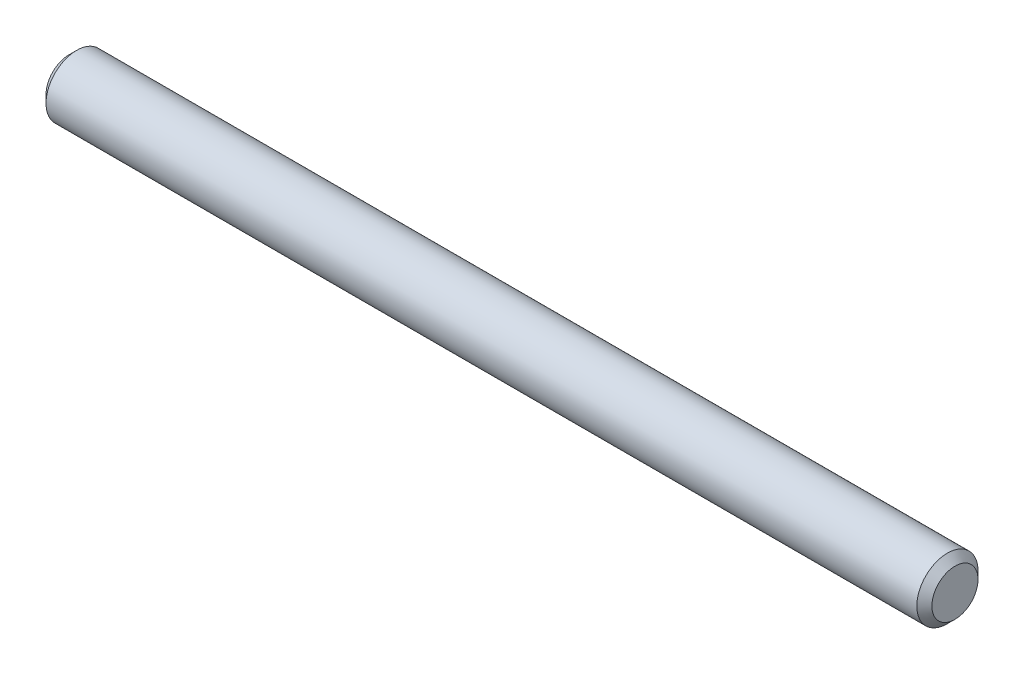
ISO-10303-21;
HEADER;
FILE_DESCRIPTION(('STEP AP214'),'2;1');
FILE_NAME('part.step','',(''),(''),'','','');
FILE_SCHEMA(('AUTOMOTIVE_DESIGN { 1 0 10303 214 1 1 1 1 }'));
ENDSEC;
DATA;
#1=APPLICATION_CONTEXT('core data for automotive mechanical design processes');
#2=APPLICATION_PROTOCOL_DEFINITION('international standard','automotive_design',2000,#1);
#3=PRODUCT_CONTEXT('',#1,'mechanical');
#4=PRODUCT('Part','Part','',(#3));
#5=PRODUCT_RELATED_PRODUCT_CATEGORY('part','',(#4));
#6=PRODUCT_DEFINITION_FORMATION('','',#4);
#7=PRODUCT_DEFINITION_CONTEXT('part definition',#1,'design');
#8=PRODUCT_DEFINITION('design','',#6,#7);
#9=PRODUCT_DEFINITION_SHAPE('','',#8);
#10=(LENGTH_UNIT() NAMED_UNIT(*) SI_UNIT(.MILLI.,.METRE.));
#11=(NAMED_UNIT(*) PLANE_ANGLE_UNIT() SI_UNIT($,.RADIAN.));
#12=(NAMED_UNIT(*) SI_UNIT($,.STERADIAN.) SOLID_ANGLE_UNIT());
#13=UNCERTAINTY_MEASURE_WITH_UNIT(LENGTH_MEASURE(1.E-05),#10,'distance_accuracy_value','');
#14=(GEOMETRIC_REPRESENTATION_CONTEXT(3) GLOBAL_UNCERTAINTY_ASSIGNED_CONTEXT((#13)) GLOBAL_UNIT_ASSIGNED_CONTEXT((#10,
#11,#12)) REPRESENTATION_CONTEXT('',''));
#15=CARTESIAN_POINT('',(0.,0.,0.));
#16=DIRECTION('',(0.,0.,1.));
#17=DIRECTION('',(1.,0.,0.));
#18=AXIS2_PLACEMENT_3D('',#15,#16,#17);
#19=CARTESIAN_POINT('',(-34.925,0.,0.));
#20=DIRECTION('',(1.,0.,0.));
#21=DIRECTION('',(0.,0.,-1.));
#22=AXIS2_PLACEMENT_3D('',#19,#20,#21);
#23=CYLINDRICAL_SURFACE('',#22,2.413);
#24=CARTESIAN_POINT('',(-34.3296875,0.,0.));
#25=DIRECTION('',(1.,0.,0.));
#26=DIRECTION('',(0.,0.,-1.));
#27=AXIS2_PLACEMENT_3D('',#24,#25,#26);
#28=CIRCLE('',#27,2.413);
#29=CARTESIAN_POINT('',(-34.3296875,0.,-2.413));
#30=VERTEX_POINT('',#29);
#31=EDGE_CURVE('E43',#30,#30,#28,.T.);
#32=ORIENTED_EDGE('',*,*,#31,.T.);
#33=EDGE_LOOP('',(#32));
#34=FACE_BOUND('',#33,.T.);
#35=CARTESIAN_POINT('',(34.3296875,0.,0.));
#36=DIRECTION('',(1.,0.,0.));
#37=DIRECTION('',(0.,0.,-1.));
#38=AXIS2_PLACEMENT_3D('',#35,#36,#37);
#39=CIRCLE('',#38,2.413);
#40=CARTESIAN_POINT('',(34.3296875,0.,-2.413));
#41=VERTEX_POINT('',#40);
#42=EDGE_CURVE('E47',#41,#41,#39,.F.);
#43=ORIENTED_EDGE('',*,*,#42,.T.);
#44=EDGE_LOOP('',(#43));
#45=FACE_BOUND('',#44,.T.);
#46=ADVANCED_FACE('F32',(#34,#45),#23,.T.);
#47=CARTESIAN_POINT('',(-34.925,0.,0.));
#48=DIRECTION('',(1.,0.,0.));
#49=DIRECTION('',(0.,0.,-1.));
#50=AXIS2_PLACEMENT_3D('',#47,#48,#49);
#51=PLANE('',#50);
#52=CARTESIAN_POINT('',(-34.925,0.,0.));
#53=DIRECTION('',(1.,0.,0.));
#54=DIRECTION('',(0.,0.,-1.));
#55=AXIS2_PLACEMENT_3D('',#52,#53,#54);
#56=CIRCLE('',#55,1.81768749999998);
#57=CARTESIAN_POINT('',(-34.925,0.,-1.81768749999998));
#58=VERTEX_POINT('',#57);
#59=EDGE_CURVE('E39',#58,#58,#56,.F.);
#60=ORIENTED_EDGE('',*,*,#59,.T.);
#61=EDGE_LOOP('',(#60));
#62=FACE_BOUND('',#61,.T.);
#63=ADVANCED_FACE('F63',(#62),#51,.F.);
#64=CARTESIAN_POINT('',(34.925,0.,0.));
#65=DIRECTION('',(1.,0.,0.));
#66=DIRECTION('',(0.,0.,-1.));
#67=AXIS2_PLACEMENT_3D('',#64,#65,#66);
#68=PLANE('',#67);
#69=CARTESIAN_POINT('',(34.925,0.,0.));
#70=DIRECTION('',(1.,0.,0.));
#71=DIRECTION('',(0.,0.,-1.));
#72=AXIS2_PLACEMENT_3D('',#69,#70,#71);
#73=CIRCLE('',#72,1.8176875);
#74=CARTESIAN_POINT('',(34.925,0.,-1.8176875));
#75=VERTEX_POINT('',#74);
#76=EDGE_CURVE('E10',#75,#75,#73,.T.);
#77=ORIENTED_EDGE('',*,*,#76,.T.);
#78=EDGE_LOOP('',(#77));
#79=FACE_BOUND('',#78,.T.);
#80=ADVANCED_FACE('F60',(#79),#68,.T.);
#81=CARTESIAN_POINT('',(-34.3296875,0.,0.));
#82=DIRECTION('',(1.,0.,0.));
#83=DIRECTION('',(0.,0.,-1.));
#84=AXIS2_PLACEMENT_3D('',#81,#82,#83);
#85=CONICAL_SURFACE('',#84,2.413,0.785398163397456);
#86=ORIENTED_EDGE('',*,*,#59,.F.);
#87=EDGE_LOOP('',(#86));
#88=FACE_BOUND('',#87,.T.);
#89=ORIENTED_EDGE('',*,*,#31,.F.);
#90=EDGE_LOOP('',(#89));
#91=FACE_BOUND('',#90,.T.);
#92=ADVANCED_FACE('F56',(#88,#91),#85,.T.);
#93=CARTESIAN_POINT('',(34.925,0.,0.));
#94=DIRECTION('',(-1.,0.,0.));
#95=DIRECTION('',(0.,0.,1.));
#96=AXIS2_PLACEMENT_3D('',#93,#94,#95);
#97=CONICAL_SURFACE('',#96,1.8176875,0.78539816339745);
#98=ORIENTED_EDGE('',*,*,#42,.F.);
#99=EDGE_LOOP('',(#98));
#100=FACE_BOUND('',#99,.T.);
#101=ORIENTED_EDGE('',*,*,#76,.F.);
#102=EDGE_LOOP('',(#101));
#103=FACE_BOUND('',#102,.T.);
#104=ADVANCED_FACE('F34',(#100,#103),#97,.T.);
#105=CLOSED_SHELL('',(#46,#63,#80,#92,#104));
#106=MANIFOLD_SOLID_BREP('B2',#105);
#107=ADVANCED_BREP_SHAPE_REPRESENTATION('',(#18,#106),#14);
#108=SHAPE_DEFINITION_REPRESENTATION(#9,#107);
ENDSEC;
END-ISO-10303-21;
